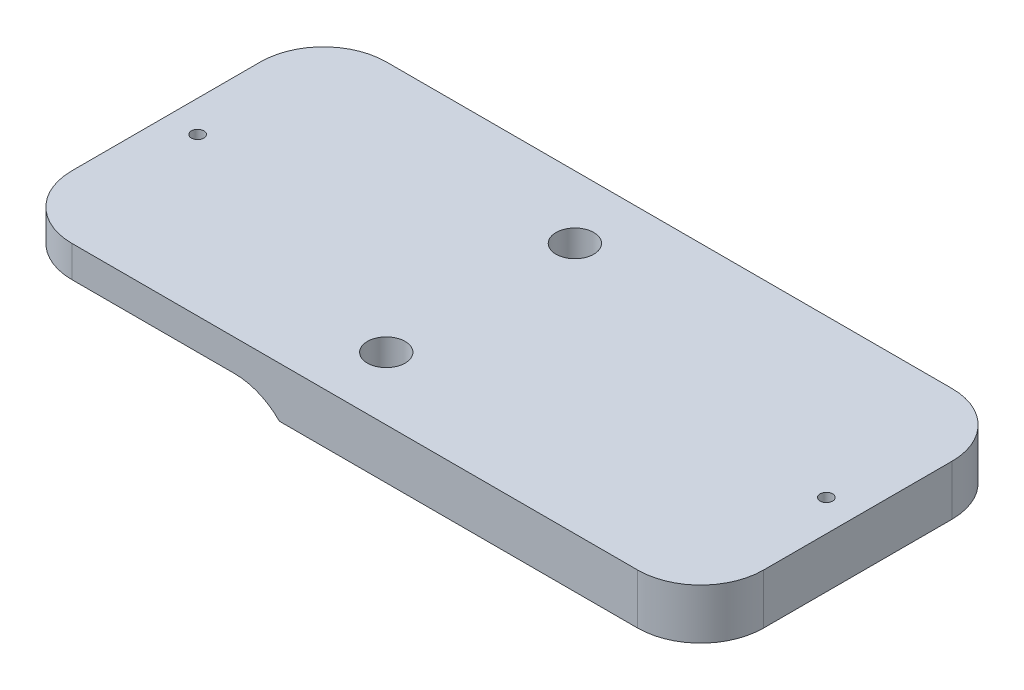
ISO-10303-21;
HEADER;
FILE_DESCRIPTION(('STEP AP214'),'2;1');
FILE_NAME('part.step','',(''),(''),'','','');
FILE_SCHEMA(('AUTOMOTIVE_DESIGN { 1 0 10303 214 1 1 1 1 }'));
ENDSEC;
DATA;
#1=APPLICATION_CONTEXT('core data for automotive mechanical design processes');
#2=APPLICATION_PROTOCOL_DEFINITION('international standard','automotive_design',2000,#1);
#3=PRODUCT_CONTEXT('',#1,'mechanical');
#4=PRODUCT('Part','Part','',(#3));
#5=PRODUCT_RELATED_PRODUCT_CATEGORY('part','',(#4));
#6=PRODUCT_DEFINITION_FORMATION('','',#4);
#7=PRODUCT_DEFINITION_CONTEXT('part definition',#1,'design');
#8=PRODUCT_DEFINITION('design','',#6,#7);
#9=PRODUCT_DEFINITION_SHAPE('','',#8);
#10=(LENGTH_UNIT() NAMED_UNIT(*) SI_UNIT(.MILLI.,.METRE.));
#11=(NAMED_UNIT(*) PLANE_ANGLE_UNIT() SI_UNIT($,.RADIAN.));
#12=(NAMED_UNIT(*) SI_UNIT($,.STERADIAN.) SOLID_ANGLE_UNIT());
#13=UNCERTAINTY_MEASURE_WITH_UNIT(LENGTH_MEASURE(1.E-05),#10,'distance_accuracy_value','');
#14=(GEOMETRIC_REPRESENTATION_CONTEXT(3) GLOBAL_UNCERTAINTY_ASSIGNED_CONTEXT((#13)) GLOBAL_UNIT_ASSIGNED_CONTEXT((#10,
#11,#12)) REPRESENTATION_CONTEXT('',''));
#15=CARTESIAN_POINT('',(0.,0.,0.));
#16=DIRECTION('',(0.,0.,1.));
#17=DIRECTION('',(1.,0.,0.));
#18=AXIS2_PLACEMENT_3D('',#15,#16,#17);
#19=CARTESIAN_POINT('',(50.,8.,-40.));
#20=DIRECTION('',(0.,-1.,0.));
#21=DIRECTION('',(0.,0.,-1.));
#22=AXIS2_PLACEMENT_3D('',#19,#20,#21);
#23=CYLINDRICAL_SURFACE('',#22,1.75);
#24=CARTESIAN_POINT('',(50.,0.,-40.));
#25=DIRECTION('',(0.,1.,0.));
#26=DIRECTION('',(0.,0.,1.));
#27=AXIS2_PLACEMENT_3D('',#24,#25,#26);
#28=CIRCLE('',#27,1.75);
#29=CARTESIAN_POINT('',(50.,0.,-38.25));
#30=VERTEX_POINT('',#29);
#31=EDGE_CURVE('E193',#30,#30,#28,.T.);
#32=ORIENTED_EDGE('',*,*,#31,.F.);
#33=EDGE_LOOP('',(#32));
#34=FACE_BOUND('',#33,.T.);
#35=CARTESIAN_POINT('',(50.,3.,-40.));
#36=DIRECTION('',(0.,1.,0.));
#37=DIRECTION('',(0.,0.,1.));
#38=AXIS2_PLACEMENT_3D('',#35,#36,#37);
#39=CIRCLE('',#38,1.75);
#40=CARTESIAN_POINT('',(50.,3.,-38.25));
#41=VERTEX_POINT('',#40);
#42=EDGE_CURVE('E136',#41,#41,#39,.T.);
#43=ORIENTED_EDGE('',*,*,#42,.T.);
#44=EDGE_LOOP('',(#43));
#45=FACE_BOUND('',#44,.T.);
#46=ADVANCED_FACE('F39',(#34,#45),#23,.F.);
#47=CARTESIAN_POINT('',(50.,8.,-10.));
#48=DIRECTION('',(0.,-1.,0.));
#49=DIRECTION('',(0.,0.,-1.));
#50=AXIS2_PLACEMENT_3D('',#47,#48,#49);
#51=CYLINDRICAL_SURFACE('',#50,1.75);
#52=CARTESIAN_POINT('',(50.,0.,-10.));
#53=DIRECTION('',(0.,1.,0.));
#54=DIRECTION('',(0.,0.,1.));
#55=AXIS2_PLACEMENT_3D('',#52,#53,#54);
#56=CIRCLE('',#55,1.75);
#57=CARTESIAN_POINT('',(50.,0.,-8.25));
#58=VERTEX_POINT('',#57);
#59=EDGE_CURVE('E189',#58,#58,#56,.T.);
#60=ORIENTED_EDGE('',*,*,#59,.F.);
#61=EDGE_LOOP('',(#60));
#62=FACE_BOUND('',#61,.T.);
#63=CARTESIAN_POINT('',(50.,3.,-10.));
#64=DIRECTION('',(0.,1.,0.));
#65=DIRECTION('',(0.,0.,1.));
#66=AXIS2_PLACEMENT_3D('',#63,#64,#65);
#67=CIRCLE('',#66,1.75);
#68=CARTESIAN_POINT('',(50.,3.,-8.25));
#69=VERTEX_POINT('',#68);
#70=EDGE_CURVE('E211',#69,#69,#67,.T.);
#71=ORIENTED_EDGE('',*,*,#70,.T.);
#72=EDGE_LOOP('',(#71));
#73=FACE_BOUND('',#72,.T.);
#74=ADVANCED_FACE('F271',(#62,#73),#51,.F.);
#75=CARTESIAN_POINT('',(0.,8.,0.));
#76=DIRECTION('',(1.,0.,0.));
#77=DIRECTION('',(0.,0.,-1.));
#78=AXIS2_PLACEMENT_3D('',#75,#76,#77);
#79=PLANE('',#78);
#80=DIRECTION('',(0.,0.,1.));
#81=VECTOR('',#80,1.);
#82=CARTESIAN_POINT('',(0.,8.,0.));
#83=LINE('',#82,#81);
#84=CARTESIAN_POINT('',(0.,8.,-40.));
#85=VERTEX_POINT('',#84);
#86=CARTESIAN_POINT('',(0.,8.,-10.));
#87=VERTEX_POINT('',#86);
#88=EDGE_CURVE('E126',#85,#87,#83,.T.);
#89=ORIENTED_EDGE('',*,*,#88,.F.);
#90=DIRECTION('',(0.,-1.,0.));
#91=VECTOR('',#90,1.);
#92=CARTESIAN_POINT('',(0.,8.,-40.));
#93=LINE('',#92,#91);
#94=CARTESIAN_POINT('',(0.,3.,-40.));
#95=VERTEX_POINT('',#94);
#96=EDGE_CURVE('E144',#85,#95,#93,.T.);
#97=ORIENTED_EDGE('',*,*,#96,.T.);
#98=DIRECTION('',(0.,0.,-1.));
#99=VECTOR('',#98,1.);
#100=CARTESIAN_POINT('',(0.,3.,0.));
#101=LINE('',#100,#99);
#102=CARTESIAN_POINT('',(0.,3.,-10.));
#103=VERTEX_POINT('',#102);
#104=EDGE_CURVE('E135',#103,#95,#101,.T.);
#105=ORIENTED_EDGE('',*,*,#104,.F.);
#106=DIRECTION('',(0.,-1.,0.));
#107=VECTOR('',#106,1.);
#108=CARTESIAN_POINT('',(0.,8.,-10.));
#109=LINE('',#108,#107);
#110=EDGE_CURVE('E141',#103,#87,#109,.F.);
#111=ORIENTED_EDGE('',*,*,#110,.T.);
#112=EDGE_LOOP('',(#89,#97,#105,#111));
#113=FACE_BOUND('',#112,.T.);
#114=ADVANCED_FACE('F243',(#113),#79,.F.);
#115=CARTESIAN_POINT('',(0.,8.,0.));
#116=DIRECTION('',(0.,-1.,0.));
#117=DIRECTION('',(0.,0.,-1.));
#118=AXIS2_PLACEMENT_3D('',#115,#116,#117);
#119=PLANE('',#118);
#120=CARTESIAN_POINT('',(4.99999999999999,8.,-25.));
#121=DIRECTION('',(0.,1.,0.));
#122=DIRECTION('',(0.,0.,1.));
#123=AXIS2_PLACEMENT_3D('',#120,#121,#122);
#124=CIRCLE('',#123,1.);
#125=CARTESIAN_POINT('',(4.99999999999999,8.,-24.));
#126=VERTEX_POINT('',#125);
#127=EDGE_CURVE('E360',#126,#126,#124,.T.);
#128=ORIENTED_EDGE('',*,*,#127,.F.);
#129=EDGE_LOOP('',(#128));
#130=FACE_BOUND('',#129,.T.);
#131=CARTESIAN_POINT('',(105.,8.,-25.));
#132=DIRECTION('',(0.,1.,0.));
#133=DIRECTION('',(0.,0.,1.));
#134=AXIS2_PLACEMENT_3D('',#131,#132,#133);
#135=CIRCLE('',#134,0.999999999999998);
#136=CARTESIAN_POINT('',(105.,8.,-24.));
#137=VERTEX_POINT('',#136);
#138=EDGE_CURVE('E362',#137,#137,#135,.T.);
#139=ORIENTED_EDGE('',*,*,#138,.F.);
#140=EDGE_LOOP('',(#139));
#141=FACE_BOUND('',#140,.T.);
#142=CARTESIAN_POINT('',(50.,8.,-40.));
#143=DIRECTION('',(0.,1.,0.));
#144=DIRECTION('',(0.,0.,1.));
#145=AXIS2_PLACEMENT_3D('',#142,#143,#144);
#146=CIRCLE('',#145,3.);
#147=CARTESIAN_POINT('',(50.,8.,-37.));
#148=VERTEX_POINT('',#147);
#149=EDGE_CURVE('E227',#148,#148,#146,.T.);
#150=ORIENTED_EDGE('',*,*,#149,.F.);
#151=EDGE_LOOP('',(#150));
#152=FACE_BOUND('',#151,.T.);
#153=CARTESIAN_POINT('',(50.,8.,-10.));
#154=DIRECTION('',(0.,1.,0.));
#155=DIRECTION('',(0.,0.,1.));
#156=AXIS2_PLACEMENT_3D('',#153,#154,#155);
#157=CIRCLE('',#156,3.);
#158=CARTESIAN_POINT('',(50.,8.,-7.));
#159=VERTEX_POINT('',#158);
#160=EDGE_CURVE('E230',#159,#159,#157,.T.);
#161=ORIENTED_EDGE('',*,*,#160,.F.);
#162=EDGE_LOOP('',(#161));
#163=FACE_BOUND('',#162,.T.);
#164=DIRECTION('',(-1.,0.,0.));
#165=VECTOR('',#164,1.);
#166=CARTESIAN_POINT('',(0.,8.,-50.));
#167=LINE('',#166,#165);
#168=CARTESIAN_POINT('',(100.,8.,-50.));
#169=VERTEX_POINT('',#168);
#170=CARTESIAN_POINT('',(10.,8.,-50.));
#171=VERTEX_POINT('',#170);
#172=EDGE_CURVE('E206',#169,#171,#167,.T.);
#173=ORIENTED_EDGE('',*,*,#172,.T.);
#174=CARTESIAN_POINT('',(10.,8.,-40.));
#175=DIRECTION('',(0.,-1.,0.));
#176=DIRECTION('',(0.,0.,-1.));
#177=AXIS2_PLACEMENT_3D('',#174,#175,#176);
#178=CIRCLE('',#177,10.);
#179=EDGE_CURVE('E164',#171,#85,#178,.F.);
#180=ORIENTED_EDGE('',*,*,#179,.T.);
#181=ORIENTED_EDGE('',*,*,#88,.T.);
#182=CARTESIAN_POINT('',(10.,8.,-10.));
#183=DIRECTION('',(0.,-1.,0.));
#184=DIRECTION('',(0.,0.,-1.));
#185=AXIS2_PLACEMENT_3D('',#182,#183,#184);
#186=CIRCLE('',#185,10.);
#187=CARTESIAN_POINT('',(10.,8.,0.));
#188=VERTEX_POINT('',#187);
#189=EDGE_CURVE('E158',#87,#188,#186,.F.);
#190=ORIENTED_EDGE('',*,*,#189,.T.);
#191=DIRECTION('',(1.,0.,0.));
#192=VECTOR('',#191,1.);
#193=CARTESIAN_POINT('',(0.,8.,0.));
#194=LINE('',#193,#192);
#195=CARTESIAN_POINT('',(100.,8.,0.));
#196=VERTEX_POINT('',#195);
#197=EDGE_CURVE('E182',#188,#196,#194,.T.);
#198=ORIENTED_EDGE('',*,*,#197,.T.);
#199=CARTESIAN_POINT('',(100.,8.,-10.));
#200=DIRECTION('',(0.,-1.,0.));
#201=DIRECTION('',(0.,0.,-1.));
#202=AXIS2_PLACEMENT_3D('',#199,#200,#201);
#203=CIRCLE('',#202,10.);
#204=CARTESIAN_POINT('',(110.,8.,-10.));
#205=VERTEX_POINT('',#204);
#206=EDGE_CURVE('E160',#196,#205,#203,.F.);
#207=ORIENTED_EDGE('',*,*,#206,.T.);
#208=DIRECTION('',(0.,0.,-1.));
#209=VECTOR('',#208,1.);
#210=CARTESIAN_POINT('',(110.,8.,0.));
#211=LINE('',#210,#209);
#212=CARTESIAN_POINT('',(110.,8.,-40.));
#213=VERTEX_POINT('',#212);
#214=EDGE_CURVE('E203',#205,#213,#211,.T.);
#215=ORIENTED_EDGE('',*,*,#214,.T.);
#216=CARTESIAN_POINT('',(100.,8.,-40.));
#217=DIRECTION('',(0.,-1.,0.));
#218=DIRECTION('',(0.,0.,-1.));
#219=AXIS2_PLACEMENT_3D('',#216,#217,#218);
#220=CIRCLE('',#219,10.);
#221=EDGE_CURVE('E162',#213,#169,#220,.F.);
#222=ORIENTED_EDGE('',*,*,#221,.T.);
#223=EDGE_LOOP('',(#173,#180,#181,#190,#198,#207,#215,#222));
#224=FACE_BOUND('',#223,.T.);
#225=ADVANCED_FACE('F246',(#130,#141,#152,#163,#224),#119,.F.);
#226=CARTESIAN_POINT('',(0.,0.,0.));
#227=DIRECTION('',(0.,-1.,0.));
#228=DIRECTION('',(0.,0.,-1.));
#229=AXIS2_PLACEMENT_3D('',#226,#227,#228);
#230=PLANE('',#229);
#231=CARTESIAN_POINT('',(105.,0.,-25.));
#232=DIRECTION('',(0.,1.,0.));
#233=DIRECTION('',(0.,0.,1.));
#234=AXIS2_PLACEMENT_3D('',#231,#232,#233);
#235=CIRCLE('',#234,0.999999999999998);
#236=CARTESIAN_POINT('',(105.,0.,-24.));
#237=VERTEX_POINT('',#236);
#238=EDGE_CURVE('E233',#237,#237,#235,.T.);
#239=ORIENTED_EDGE('',*,*,#238,.T.);
#240=EDGE_LOOP('',(#239));
#241=FACE_BOUND('',#240,.T.);
#242=DIRECTION('',(-1.,0.,0.));
#243=VECTOR('',#242,1.);
#244=CARTESIAN_POINT('',(0.,0.,-50.));
#245=LINE('',#244,#243);
#246=CARTESIAN_POINT('',(100.,0.,-50.));
#247=VERTEX_POINT('',#246);
#248=CARTESIAN_POINT('',(43.,0.,-50.));
#249=VERTEX_POINT('',#248);
#250=EDGE_CURVE('E116',#247,#249,#245,.T.);
#251=ORIENTED_EDGE('',*,*,#250,.F.);
#252=CARTESIAN_POINT('',(100.,0.,-40.));
#253=DIRECTION('',(0.,-1.,0.));
#254=DIRECTION('',(0.,0.,-1.));
#255=AXIS2_PLACEMENT_3D('',#252,#253,#254);
#256=CIRCLE('',#255,10.);
#257=CARTESIAN_POINT('',(110.,0.,-40.));
#258=VERTEX_POINT('',#257);
#259=EDGE_CURVE('E61',#247,#258,#256,.T.);
#260=ORIENTED_EDGE('',*,*,#259,.T.);
#261=DIRECTION('',(0.,0.,-1.));
#262=VECTOR('',#261,1.);
#263=CARTESIAN_POINT('',(110.,0.,0.));
#264=LINE('',#263,#262);
#265=CARTESIAN_POINT('',(110.,0.,-10.));
#266=VERTEX_POINT('',#265);
#267=EDGE_CURVE('E127',#266,#258,#264,.T.);
#268=ORIENTED_EDGE('',*,*,#267,.F.);
#269=CARTESIAN_POINT('',(100.,0.,-10.));
#270=DIRECTION('',(0.,-1.,0.));
#271=DIRECTION('',(0.,0.,-1.));
#272=AXIS2_PLACEMENT_3D('',#269,#270,#271);
#273=CIRCLE('',#272,10.);
#274=CARTESIAN_POINT('',(100.,0.,0.));
#275=VERTEX_POINT('',#274);
#276=EDGE_CURVE('E55',#266,#275,#273,.T.);
#277=ORIENTED_EDGE('',*,*,#276,.T.);
#278=DIRECTION('',(1.,0.,0.));
#279=VECTOR('',#278,1.);
#280=CARTESIAN_POINT('',(0.,0.,0.));
#281=LINE('',#280,#279);
#282=CARTESIAN_POINT('',(43.,0.,0.));
#283=VERTEX_POINT('',#282);
#284=EDGE_CURVE('E133',#283,#275,#281,.T.);
#285=ORIENTED_EDGE('',*,*,#284,.F.);
#286=DIRECTION('',(0.,0.,1.));
#287=VECTOR('',#286,1.);
#288=CARTESIAN_POINT('',(43.,0.,0.));
#289=LINE('',#288,#287);
#290=EDGE_CURVE('E130',#249,#283,#289,.T.);
#291=ORIENTED_EDGE('',*,*,#290,.F.);
#292=EDGE_LOOP('',(#251,#260,#268,#277,#285,#291));
#293=FACE_BOUND('',#292,.T.);
#294=ORIENTED_EDGE('',*,*,#31,.T.);
#295=EDGE_LOOP('',(#294));
#296=FACE_BOUND('',#295,.T.);
#297=ORIENTED_EDGE('',*,*,#59,.T.);
#298=EDGE_LOOP('',(#297));
#299=FACE_BOUND('',#298,.T.);
#300=ADVANCED_FACE('F131',(#241,#293,#296,#299),#230,.T.);
#301=CARTESIAN_POINT('',(0.,8.,0.));
#302=DIRECTION('',(0.,0.,-1.));
#303=DIRECTION('',(-1.,0.,0.));
#304=AXIS2_PLACEMENT_3D('',#301,#302,#303);
#305=PLANE('',#304);
#306=ORIENTED_EDGE('',*,*,#284,.T.);
#307=DIRECTION('',(0.,-1.,0.));
#308=VECTOR('',#307,1.);
#309=CARTESIAN_POINT('',(100.,8.,0.));
#310=LINE('',#309,#308);
#311=EDGE_CURVE('E11',#275,#196,#310,.F.);
#312=ORIENTED_EDGE('',*,*,#311,.T.);
#313=ORIENTED_EDGE('',*,*,#197,.F.);
#314=DIRECTION('',(0.,-1.,0.));
#315=VECTOR('',#314,1.);
#316=CARTESIAN_POINT('',(10.,8.,0.));
#317=LINE('',#316,#315);
#318=CARTESIAN_POINT('',(10.,3.,0.));
#319=VERTEX_POINT('',#318);
#320=EDGE_CURVE('E48',#188,#319,#317,.T.);
#321=ORIENTED_EDGE('',*,*,#320,.T.);
#322=DIRECTION('',(-1.,0.,0.));
#323=VECTOR('',#322,1.);
#324=CARTESIAN_POINT('',(0.,3.,0.));
#325=LINE('',#324,#323);
#326=CARTESIAN_POINT('',(35.8585715714571,3.,0.));
#327=VERTEX_POINT('',#326);
#328=EDGE_CURVE('E180',#327,#319,#325,.T.);
#329=ORIENTED_EDGE('',*,*,#328,.F.);
#330=CARTESIAN_POINT('',(35.8585715714571,-7.,0.));
#331=DIRECTION('',(0.,0.,-1.));
#332=DIRECTION('',(-1.,0.,0.));
#333=AXIS2_PLACEMENT_3D('',#330,#331,#332);
#334=CIRCLE('',#333,10.);
#335=EDGE_CURVE('E142',#327,#283,#334,.T.);
#336=ORIENTED_EDGE('',*,*,#335,.T.);
#337=EDGE_LOOP('',(#306,#312,#313,#321,#329,#336));
#338=FACE_BOUND('',#337,.T.);
#339=ADVANCED_FACE('F179',(#338),#305,.F.);
#340=CARTESIAN_POINT('',(110.,8.,0.));
#341=DIRECTION('',(-1.,0.,0.));
#342=DIRECTION('',(0.,0.,1.));
#343=AXIS2_PLACEMENT_3D('',#340,#341,#342);
#344=PLANE('',#343);
#345=ORIENTED_EDGE('',*,*,#267,.T.);
#346=DIRECTION('',(0.,-1.,0.));
#347=VECTOR('',#346,1.);
#348=CARTESIAN_POINT('',(110.,8.,-40.));
#349=LINE('',#348,#347);
#350=EDGE_CURVE('E171',#258,#213,#349,.F.);
#351=ORIENTED_EDGE('',*,*,#350,.T.);
#352=ORIENTED_EDGE('',*,*,#214,.F.);
#353=DIRECTION('',(0.,-1.,0.));
#354=VECTOR('',#353,1.);
#355=CARTESIAN_POINT('',(110.,8.,-10.));
#356=LINE('',#355,#354);
#357=EDGE_CURVE('E168',#205,#266,#356,.T.);
#358=ORIENTED_EDGE('',*,*,#357,.T.);
#359=EDGE_LOOP('',(#345,#351,#352,#358));
#360=FACE_BOUND('',#359,.T.);
#361=ADVANCED_FACE('F258',(#360),#344,.F.);
#362=CARTESIAN_POINT('',(0.,8.,-50.));
#363=DIRECTION('',(0.,0.,1.));
#364=DIRECTION('',(1.,0.,0.));
#365=AXIS2_PLACEMENT_3D('',#362,#363,#364);
#366=PLANE('',#365);
#367=DIRECTION('',(1.,0.,0.));
#368=VECTOR('',#367,1.);
#369=CARTESIAN_POINT('',(0.,3.,-50.));
#370=LINE('',#369,#368);
#371=CARTESIAN_POINT('',(10.,3.,-50.));
#372=VERTEX_POINT('',#371);
#373=CARTESIAN_POINT('',(35.8585715714571,3.,-50.));
#374=VERTEX_POINT('',#373);
#375=EDGE_CURVE('E190',#372,#374,#370,.T.);
#376=ORIENTED_EDGE('',*,*,#375,.F.);
#377=DIRECTION('',(0.,-1.,0.));
#378=VECTOR('',#377,1.);
#379=CARTESIAN_POINT('',(10.,8.,-50.));
#380=LINE('',#379,#378);
#381=EDGE_CURVE('E156',#372,#171,#380,.F.);
#382=ORIENTED_EDGE('',*,*,#381,.T.);
#383=ORIENTED_EDGE('',*,*,#172,.F.);
#384=DIRECTION('',(0.,-1.,0.));
#385=VECTOR('',#384,1.);
#386=CARTESIAN_POINT('',(100.,8.,-50.));
#387=LINE('',#386,#385);
#388=EDGE_CURVE('E125',#169,#247,#387,.T.);
#389=ORIENTED_EDGE('',*,*,#388,.T.);
#390=ORIENTED_EDGE('',*,*,#250,.T.);
#391=CARTESIAN_POINT('',(35.8585715714571,-7.,-50.));
#392=DIRECTION('',(0.,0.,1.));
#393=DIRECTION('',(1.,0.,0.));
#394=AXIS2_PLACEMENT_3D('',#391,#392,#393);
#395=CIRCLE('',#394,10.);
#396=EDGE_CURVE('E121',#249,#374,#395,.T.);
#397=ORIENTED_EDGE('',*,*,#396,.T.);
#398=EDGE_LOOP('',(#376,#382,#383,#389,#390,#397));
#399=FACE_BOUND('',#398,.T.);
#400=ADVANCED_FACE('F119',(#399),#366,.F.);
#401=CARTESIAN_POINT('',(0.,3.,0.));
#402=DIRECTION('',(0.,-1.,0.));
#403=DIRECTION('',(0.,0.,-1.));
#404=AXIS2_PLACEMENT_3D('',#401,#402,#403);
#405=PLANE('',#404);
#406=CARTESIAN_POINT('',(4.99999999999999,3.,-25.));
#407=DIRECTION('',(0.,-1.,0.));
#408=DIRECTION('',(0.,0.,-1.));
#409=AXIS2_PLACEMENT_3D('',#406,#407,#408);
#410=CIRCLE('',#409,1.);
#411=CARTESIAN_POINT('',(4.99999999999999,3.,-26.));
#412=VERTEX_POINT('',#411);
#413=EDGE_CURVE('E43',#412,#412,#410,.T.);
#414=ORIENTED_EDGE('',*,*,#413,.F.);
#415=EDGE_LOOP('',(#414));
#416=FACE_BOUND('',#415,.T.);
#417=ORIENTED_EDGE('',*,*,#104,.T.);
#418=CARTESIAN_POINT('',(10.,3.,-40.));
#419=DIRECTION('',(0.,-1.,0.));
#420=DIRECTION('',(0.,0.,-1.));
#421=AXIS2_PLACEMENT_3D('',#418,#419,#420);
#422=CIRCLE('',#421,10.);
#423=EDGE_CURVE('E153',#95,#372,#422,.T.);
#424=ORIENTED_EDGE('',*,*,#423,.T.);
#425=ORIENTED_EDGE('',*,*,#375,.T.);
#426=DIRECTION('',(0.,0.,1.));
#427=VECTOR('',#426,1.);
#428=CARTESIAN_POINT('',(35.8585715714571,3.,0.));
#429=LINE('',#428,#427);
#430=EDGE_CURVE('E140',#374,#327,#429,.T.);
#431=ORIENTED_EDGE('',*,*,#430,.T.);
#432=ORIENTED_EDGE('',*,*,#328,.T.);
#433=CARTESIAN_POINT('',(10.,3.,-10.));
#434=DIRECTION('',(0.,-1.,0.));
#435=DIRECTION('',(0.,0.,-1.));
#436=AXIS2_PLACEMENT_3D('',#433,#434,#435);
#437=CIRCLE('',#436,10.);
#438=EDGE_CURVE('E151',#319,#103,#437,.T.);
#439=ORIENTED_EDGE('',*,*,#438,.T.);
#440=EDGE_LOOP('',(#417,#424,#425,#431,#432,#439));
#441=FACE_BOUND('',#440,.T.);
#442=ADVANCED_FACE('F187',(#416,#441),#405,.T.);
#443=CARTESIAN_POINT('',(50.,3.,-10.));
#444=DIRECTION('',(0.,1.,0.));
#445=DIRECTION('',(0.,0.,1.));
#446=AXIS2_PLACEMENT_3D('',#443,#444,#445);
#447=CYLINDRICAL_SURFACE('',#446,3.);
#448=CARTESIAN_POINT('',(50.,3.,-10.));
#449=DIRECTION('',(0.,1.,0.));
#450=DIRECTION('',(0.,0.,1.));
#451=AXIS2_PLACEMENT_3D('',#448,#449,#450);
#452=CIRCLE('',#451,3.);
#453=CARTESIAN_POINT('',(50.,3.,-7.));
#454=VERTEX_POINT('',#453);
#455=EDGE_CURVE('E238',#454,#454,#452,.T.);
#456=ORIENTED_EDGE('',*,*,#455,.F.);
#457=EDGE_LOOP('',(#456));
#458=FACE_BOUND('',#457,.T.);
#459=ORIENTED_EDGE('',*,*,#160,.T.);
#460=EDGE_LOOP('',(#459));
#461=FACE_BOUND('',#460,.T.);
#462=ADVANCED_FACE('F349',(#458,#461),#447,.F.);
#463=CARTESIAN_POINT('',(50.,3.,-10.));
#464=DIRECTION('',(0.,1.,0.));
#465=DIRECTION('',(0.,0.,1.));
#466=AXIS2_PLACEMENT_3D('',#463,#464,#465);
#467=PLANE('',#466);
#468=ORIENTED_EDGE('',*,*,#70,.F.);
#469=EDGE_LOOP('',(#468));
#470=FACE_BOUND('',#469,.T.);
#471=ORIENTED_EDGE('',*,*,#455,.T.);
#472=EDGE_LOOP('',(#471));
#473=FACE_BOUND('',#472,.T.);
#474=ADVANCED_FACE('F348',(#470,#473),#467,.T.);
#475=CARTESIAN_POINT('',(50.,3.,-40.));
#476=DIRECTION('',(0.,1.,0.));
#477=DIRECTION('',(0.,0.,1.));
#478=AXIS2_PLACEMENT_3D('',#475,#476,#477);
#479=CYLINDRICAL_SURFACE('',#478,3.);
#480=CARTESIAN_POINT('',(50.,3.,-40.));
#481=DIRECTION('',(0.,1.,0.));
#482=DIRECTION('',(0.,0.,1.));
#483=AXIS2_PLACEMENT_3D('',#480,#481,#482);
#484=CIRCLE('',#483,3.);
#485=CARTESIAN_POINT('',(50.,3.,-37.));
#486=VERTEX_POINT('',#485);
#487=EDGE_CURVE('E214',#486,#486,#484,.T.);
#488=ORIENTED_EDGE('',*,*,#487,.F.);
#489=EDGE_LOOP('',(#488));
#490=FACE_BOUND('',#489,.T.);
#491=ORIENTED_EDGE('',*,*,#149,.T.);
#492=EDGE_LOOP('',(#491));
#493=FACE_BOUND('',#492,.T.);
#494=ADVANCED_FACE('F222',(#490,#493),#479,.F.);
#495=CARTESIAN_POINT('',(50.,3.,-40.));
#496=DIRECTION('',(0.,1.,0.));
#497=DIRECTION('',(0.,0.,1.));
#498=AXIS2_PLACEMENT_3D('',#495,#496,#497);
#499=PLANE('',#498);
#500=ORIENTED_EDGE('',*,*,#42,.F.);
#501=EDGE_LOOP('',(#500));
#502=FACE_BOUND('',#501,.T.);
#503=ORIENTED_EDGE('',*,*,#487,.T.);
#504=EDGE_LOOP('',(#503));
#505=FACE_BOUND('',#504,.T.);
#506=ADVANCED_FACE('F219',(#502,#505),#499,.T.);
#507=CARTESIAN_POINT('',(35.8585715714571,-7.,0.));
#508=DIRECTION('',(0.,0.,-1.));
#509=DIRECTION('',(-1.,0.,0.));
#510=AXIS2_PLACEMENT_3D('',#507,#508,#509);
#511=CYLINDRICAL_SURFACE('',#510,10.);
#512=ORIENTED_EDGE('',*,*,#396,.F.);
#513=ORIENTED_EDGE('',*,*,#290,.T.);
#514=ORIENTED_EDGE('',*,*,#335,.F.);
#515=ORIENTED_EDGE('',*,*,#430,.F.);
#516=EDGE_LOOP('',(#512,#513,#514,#515));
#517=FACE_BOUND('',#516,.T.);
#518=ADVANCED_FACE('F138',(#517),#511,.F.);
#519=CARTESIAN_POINT('',(10.,8.,-40.));
#520=DIRECTION('',(0.,-1.,0.));
#521=DIRECTION('',(0.,0.,-1.));
#522=AXIS2_PLACEMENT_3D('',#519,#520,#521);
#523=CYLINDRICAL_SURFACE('',#522,10.);
#524=ORIENTED_EDGE('',*,*,#179,.F.);
#525=ORIENTED_EDGE('',*,*,#381,.F.);
#526=ORIENTED_EDGE('',*,*,#423,.F.);
#527=ORIENTED_EDGE('',*,*,#96,.F.);
#528=EDGE_LOOP('',(#524,#525,#526,#527));
#529=FACE_BOUND('',#528,.T.);
#530=ADVANCED_FACE('F250',(#529),#523,.T.);
#531=CARTESIAN_POINT('',(100.,8.,-40.));
#532=DIRECTION('',(0.,-1.,0.));
#533=DIRECTION('',(0.,0.,-1.));
#534=AXIS2_PLACEMENT_3D('',#531,#532,#533);
#535=CYLINDRICAL_SURFACE('',#534,10.);
#536=ORIENTED_EDGE('',*,*,#221,.F.);
#537=ORIENTED_EDGE('',*,*,#350,.F.);
#538=ORIENTED_EDGE('',*,*,#259,.F.);
#539=ORIENTED_EDGE('',*,*,#388,.F.);
#540=EDGE_LOOP('',(#536,#537,#538,#539));
#541=FACE_BOUND('',#540,.T.);
#542=ADVANCED_FACE('F256',(#541),#535,.T.);
#543=CARTESIAN_POINT('',(100.,8.,-10.));
#544=DIRECTION('',(0.,-1.,0.));
#545=DIRECTION('',(0.,0.,-1.));
#546=AXIS2_PLACEMENT_3D('',#543,#544,#545);
#547=CYLINDRICAL_SURFACE('',#546,10.);
#548=ORIENTED_EDGE('',*,*,#206,.F.);
#549=ORIENTED_EDGE('',*,*,#311,.F.);
#550=ORIENTED_EDGE('',*,*,#276,.F.);
#551=ORIENTED_EDGE('',*,*,#357,.F.);
#552=EDGE_LOOP('',(#548,#549,#550,#551));
#553=FACE_BOUND('',#552,.T.);
#554=ADVANCED_FACE('F261',(#553),#547,.T.);
#555=CARTESIAN_POINT('',(10.,8.,-10.));
#556=DIRECTION('',(0.,-1.,0.));
#557=DIRECTION('',(0.,0.,-1.));
#558=AXIS2_PLACEMENT_3D('',#555,#556,#557);
#559=CYLINDRICAL_SURFACE('',#558,10.);
#560=ORIENTED_EDGE('',*,*,#189,.F.);
#561=ORIENTED_EDGE('',*,*,#110,.F.);
#562=ORIENTED_EDGE('',*,*,#438,.F.);
#563=ORIENTED_EDGE('',*,*,#320,.F.);
#564=EDGE_LOOP('',(#560,#561,#562,#563));
#565=FACE_BOUND('',#564,.T.);
#566=ADVANCED_FACE('F41',(#565),#559,.T.);
#567=CARTESIAN_POINT('',(4.99999999999999,0.,-25.));
#568=DIRECTION('',(0.,1.,0.));
#569=DIRECTION('',(0.,0.,1.));
#570=AXIS2_PLACEMENT_3D('',#567,#568,#569);
#571=CYLINDRICAL_SURFACE('',#570,1.);
#572=ORIENTED_EDGE('',*,*,#413,.T.);
#573=EDGE_LOOP('',(#572));
#574=FACE_BOUND('',#573,.T.);
#575=ORIENTED_EDGE('',*,*,#127,.T.);
#576=EDGE_LOOP('',(#575));
#577=FACE_BOUND('',#576,.T.);
#578=ADVANCED_FACE('F268',(#574,#577),#571,.F.);
#579=CARTESIAN_POINT('',(105.,0.,-25.));
#580=DIRECTION('',(0.,1.,0.));
#581=DIRECTION('',(0.,0.,1.));
#582=AXIS2_PLACEMENT_3D('',#579,#580,#581);
#583=CYLINDRICAL_SURFACE('',#582,0.999999999999998);
#584=ORIENTED_EDGE('',*,*,#238,.F.);
#585=EDGE_LOOP('',(#584));
#586=FACE_BOUND('',#585,.T.);
#587=ORIENTED_EDGE('',*,*,#138,.T.);
#588=EDGE_LOOP('',(#587));
#589=FACE_BOUND('',#588,.T.);
#590=ADVANCED_FACE('F329',(#586,#589),#583,.F.);
#591=CLOSED_SHELL('',(#46,#74,#114,#225,#300,#339,#361,#400,#442,#462,#474,#494,#506,#518,#530,
#542,#554,#566,#578,#590));
#592=MANIFOLD_SOLID_BREP('B2',#591);
#593=ADVANCED_BREP_SHAPE_REPRESENTATION('',(#18,#592),#14);
#594=SHAPE_DEFINITION_REPRESENTATION(#9,#593);
ENDSEC;
END-ISO-10303-21;
